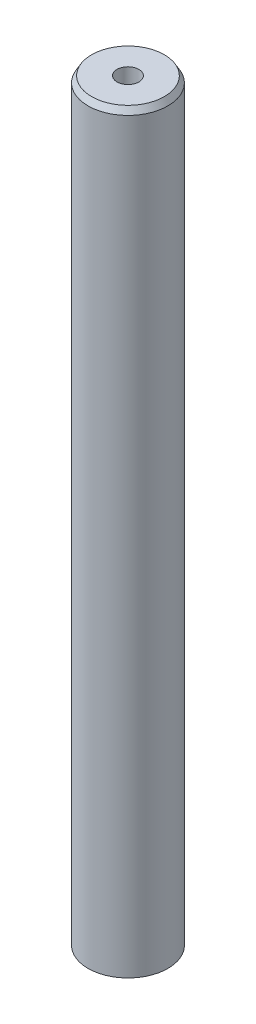
ISO-10303-21;
HEADER;
FILE_DESCRIPTION(('STEP AP214'),'2;1');
FILE_NAME('part.step','',(''),(''),'','','');
FILE_SCHEMA(('AUTOMOTIVE_DESIGN { 1 0 10303 214 1 1 1 1 }'));
ENDSEC;
DATA;
#1=APPLICATION_CONTEXT('core data for automotive mechanical design processes');
#2=APPLICATION_PROTOCOL_DEFINITION('international standard','automotive_design',2000,#1);
#3=PRODUCT_CONTEXT('',#1,'mechanical');
#4=PRODUCT('Part','Part','',(#3));
#5=PRODUCT_RELATED_PRODUCT_CATEGORY('part','',(#4));
#6=PRODUCT_DEFINITION_FORMATION('','',#4);
#7=PRODUCT_DEFINITION_CONTEXT('part definition',#1,'design');
#8=PRODUCT_DEFINITION('design','',#6,#7);
#9=PRODUCT_DEFINITION_SHAPE('','',#8);
#10=(LENGTH_UNIT() NAMED_UNIT(*) SI_UNIT(.MILLI.,.METRE.));
#11=(NAMED_UNIT(*) PLANE_ANGLE_UNIT() SI_UNIT($,.RADIAN.));
#12=(NAMED_UNIT(*) SI_UNIT($,.STERADIAN.) SOLID_ANGLE_UNIT());
#13=UNCERTAINTY_MEASURE_WITH_UNIT(LENGTH_MEASURE(1.E-05),#10,'distance_accuracy_value','');
#14=(GEOMETRIC_REPRESENTATION_CONTEXT(3) GLOBAL_UNCERTAINTY_ASSIGNED_CONTEXT((#13)) GLOBAL_UNIT_ASSIGNED_CONTEXT((#10,
#11,#12)) REPRESENTATION_CONTEXT('',''));
#15=CARTESIAN_POINT('',(0.,0.,0.));
#16=DIRECTION('',(0.,0.,1.));
#17=DIRECTION('',(1.,0.,0.));
#18=AXIS2_PLACEMENT_3D('',#15,#16,#17);
#19=CARTESIAN_POINT('',(0.,94.7806600237083,0.));
#20=DIRECTION('',(0.,-1.,0.));
#21=DIRECTION('',(0.,0.,-1.));
#22=AXIS2_PLACEMENT_3D('',#19,#20,#21);
#23=CYLINDRICAL_SURFACE('',#22,5.);
#24=CARTESIAN_POINT('',(0.,94.0015170976709,0.));
#25=DIRECTION('',(0.,1.,0.));
#26=DIRECTION('',(0.,0.,1.));
#27=AXIS2_PLACEMENT_3D('',#24,#25,#26);
#28=CIRCLE('',#27,5.);
#29=CARTESIAN_POINT('',(0.,94.0015170976709,5.));
#30=VERTEX_POINT('',#29);
#31=EDGE_CURVE('E50',#30,#30,#28,.F.);
#32=ORIENTED_EDGE('',*,*,#31,.T.);
#33=EDGE_LOOP('',(#32));
#34=FACE_BOUND('',#33,.T.);
#35=CARTESIAN_POINT('',(0.,0.449838378084891,0.));
#36=DIRECTION('',(0.,1.,0.));
#37=DIRECTION('',(0.,0.,1.));
#38=AXIS2_PLACEMENT_3D('',#35,#36,#37);
#39=CIRCLE('',#38,5.);
#40=CARTESIAN_POINT('',(0.,0.449838378084891,5.));
#41=VERTEX_POINT('',#40);
#42=EDGE_CURVE('E51',#41,#41,#39,.T.);
#43=ORIENTED_EDGE('',*,*,#42,.T.);
#44=EDGE_LOOP('',(#43));
#45=FACE_BOUND('',#44,.T.);
#46=ADVANCED_FACE('F39',(#34,#45),#23,.T.);
#47=CARTESIAN_POINT('',(0.,94.7806600237083,0.));
#48=DIRECTION('',(0.,1.,0.));
#49=DIRECTION('',(0.,0.,1.));
#50=AXIS2_PLACEMENT_3D('',#47,#48,#49);
#51=PLANE('',#50);
#52=CARTESIAN_POINT('',(0.,94.7806600237083,0.));
#53=DIRECTION('',(0.,1.,0.));
#54=DIRECTION('',(0.,0.,1.));
#55=AXIS2_PLACEMENT_3D('',#52,#53,#54);
#56=CIRCLE('',#55,4.5501616219151);
#57=CARTESIAN_POINT('',(0.,94.7806600237083,4.5501616219151));
#58=VERTEX_POINT('',#57);
#59=EDGE_CURVE('E54',#58,#58,#56,.T.);
#60=ORIENTED_EDGE('',*,*,#59,.T.);
#61=EDGE_LOOP('',(#60));
#62=FACE_BOUND('',#61,.T.);
#63=CARTESIAN_POINT('',(0.,94.7806600237083,0.));
#64=DIRECTION('',(0.,1.,0.));
#65=DIRECTION('',(0.,0.,1.));
#66=AXIS2_PLACEMENT_3D('',#63,#64,#65);
#67=CIRCLE('',#66,1.36939339783758);
#68=CARTESIAN_POINT('',(0.,94.7806600237083,1.36939339783758));
#69=VERTEX_POINT('',#68);
#70=EDGE_CURVE('E58',#69,#69,#67,.T.);
#71=ORIENTED_EDGE('',*,*,#70,.F.);
#72=EDGE_LOOP('',(#71));
#73=FACE_BOUND('',#72,.T.);
#74=ADVANCED_FACE('F69',(#62,#73),#51,.T.);
#75=CARTESIAN_POINT('',(0.,0.,0.));
#76=DIRECTION('',(0.,1.,0.));
#77=DIRECTION('',(0.,0.,1.));
#78=AXIS2_PLACEMENT_3D('',#75,#76,#77);
#79=PLANE('',#78);
#80=CARTESIAN_POINT('',(0.,0.,0.));
#81=DIRECTION('',(0.,1.,0.));
#82=DIRECTION('',(0.,0.,1.));
#83=AXIS2_PLACEMENT_3D('',#80,#81,#82);
#84=CIRCLE('',#83,4.22085707396259);
#85=CARTESIAN_POINT('',(0.,0.,4.22085707396259));
#86=VERTEX_POINT('',#85);
#87=EDGE_CURVE('E10',#86,#86,#84,.F.);
#88=ORIENTED_EDGE('',*,*,#87,.T.);
#89=EDGE_LOOP('',(#88));
#90=FACE_BOUND('',#89,.T.);
#91=CARTESIAN_POINT('',(0.,0.,0.));
#92=DIRECTION('',(0.,1.,0.));
#93=DIRECTION('',(0.,0.,1.));
#94=AXIS2_PLACEMENT_3D('',#91,#92,#93);
#95=CIRCLE('',#94,1.36939339783758);
#96=CARTESIAN_POINT('',(0.,0.,1.36939339783758));
#97=VERTEX_POINT('',#96);
#98=EDGE_CURVE('E63',#97,#97,#95,.T.);
#99=ORIENTED_EDGE('',*,*,#98,.T.);
#100=EDGE_LOOP('',(#99));
#101=FACE_BOUND('',#100,.T.);
#102=ADVANCED_FACE('F75',(#90,#101),#79,.F.);
#103=CARTESIAN_POINT('',(0.,94.7806600237083,0.));
#104=DIRECTION('',(0.,-1.,0.));
#105=DIRECTION('',(0.,0.,-1.));
#106=AXIS2_PLACEMENT_3D('',#103,#104,#105);
#107=CYLINDRICAL_SURFACE('',#106,1.36939339783758);
#108=ORIENTED_EDGE('',*,*,#70,.T.);
#109=EDGE_LOOP('',(#108));
#110=FACE_BOUND('',#109,.T.);
#111=ORIENTED_EDGE('',*,*,#98,.F.);
#112=EDGE_LOOP('',(#111));
#113=FACE_BOUND('',#112,.T.);
#114=ADVANCED_FACE('F70',(#110,#113),#107,.F.);
#115=CARTESIAN_POINT('',(0.,94.7806600237083,0.));
#116=DIRECTION('',(0.,-1.,0.));
#117=DIRECTION('',(0.,0.,-1.));
#118=AXIS2_PLACEMENT_3D('',#115,#116,#117);
#119=CONICAL_SURFACE('',#118,4.5501616219151,0.5235987755983);
#120=ORIENTED_EDGE('',*,*,#31,.F.);
#121=EDGE_LOOP('',(#120));
#122=FACE_BOUND('',#121,.T.);
#123=ORIENTED_EDGE('',*,*,#59,.F.);
#124=EDGE_LOOP('',(#123));
#125=FACE_BOUND('',#124,.T.);
#126=ADVANCED_FACE('F81',(#122,#125),#119,.T.);
#127=CARTESIAN_POINT('',(0.,0.449838378084891,0.));
#128=DIRECTION('',(0.,1.,0.));
#129=DIRECTION('',(0.,0.,1.));
#130=AXIS2_PLACEMENT_3D('',#127,#128,#129);
#131=CONICAL_SURFACE('',#130,5.,1.0471975511966);
#132=ORIENTED_EDGE('',*,*,#87,.F.);
#133=EDGE_LOOP('',(#132));
#134=FACE_BOUND('',#133,.T.);
#135=ORIENTED_EDGE('',*,*,#42,.F.);
#136=EDGE_LOOP('',(#135));
#137=FACE_BOUND('',#136,.T.);
#138=ADVANCED_FACE('F45',(#134,#137),#131,.T.);
#139=CLOSED_SHELL('',(#46,#74,#102,#114,#126,#138));
#140=MANIFOLD_SOLID_BREP('B2',#139);
#141=ADVANCED_BREP_SHAPE_REPRESENTATION('',(#18,#140),#14);
#142=SHAPE_DEFINITION_REPRESENTATION(#9,#141);
ENDSEC;
END-ISO-10303-21;
